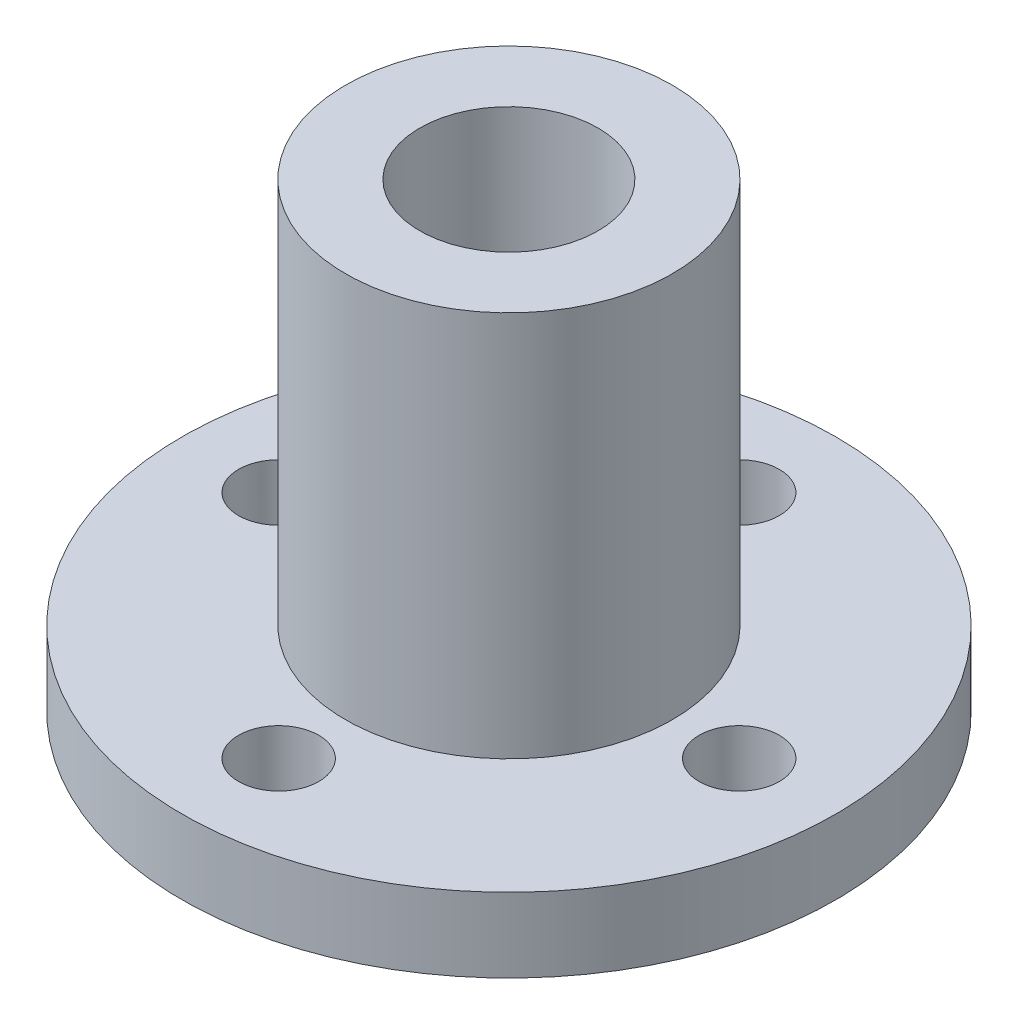
ISO-10303-21;
HEADER;
FILE_DESCRIPTION(('STEP AP214'),'2;1');
FILE_NAME('part.step','',(''),(''),'','','');
FILE_SCHEMA(('AUTOMOTIVE_DESIGN { 1 0 10303 214 1 1 1 1 }'));
ENDSEC;
DATA;
#1=APPLICATION_CONTEXT('core data for automotive mechanical design processes');
#2=APPLICATION_PROTOCOL_DEFINITION('international standard','automotive_design',2000,#1);
#3=PRODUCT_CONTEXT('',#1,'mechanical');
#4=PRODUCT('Part','Part','',(#3));
#5=PRODUCT_RELATED_PRODUCT_CATEGORY('part','',(#4));
#6=PRODUCT_DEFINITION_FORMATION('','',#4);
#7=PRODUCT_DEFINITION_CONTEXT('part definition',#1,'design');
#8=PRODUCT_DEFINITION('design','',#6,#7);
#9=PRODUCT_DEFINITION_SHAPE('','',#8);
#10=(LENGTH_UNIT() NAMED_UNIT(*) SI_UNIT(.MILLI.,.METRE.));
#11=(NAMED_UNIT(*) PLANE_ANGLE_UNIT() SI_UNIT($,.RADIAN.));
#12=(NAMED_UNIT(*) SI_UNIT($,.STERADIAN.) SOLID_ANGLE_UNIT());
#13=UNCERTAINTY_MEASURE_WITH_UNIT(LENGTH_MEASURE(1.E-05),#10,'distance_accuracy_value','');
#14=(GEOMETRIC_REPRESENTATION_CONTEXT(3) GLOBAL_UNCERTAINTY_ASSIGNED_CONTEXT((#13)) GLOBAL_UNIT_ASSIGNED_CONTEXT((#10,
#11,#12)) REPRESENTATION_CONTEXT('',''));
#15=CARTESIAN_POINT('',(0.,0.,0.));
#16=DIRECTION('',(0.,0.,1.));
#17=DIRECTION('',(1.,0.,0.));
#18=AXIS2_PLACEMENT_3D('',#15,#16,#17);
#19=CARTESIAN_POINT('',(0.,0.,0.));
#20=DIRECTION('',(0.,-1.,0.));
#21=DIRECTION('',(0.,0.,-1.));
#22=AXIS2_PLACEMENT_3D('',#19,#20,#21);
#23=CYLINDRICAL_SURFACE('',#22,6.);
#24=CARTESIAN_POINT('',(0.,0.,0.));
#25=DIRECTION('',(0.,-1.,0.));
#26=DIRECTION('',(0.,0.,-1.));
#27=AXIS2_PLACEMENT_3D('',#24,#25,#26);
#28=CIRCLE('',#27,6.);
#29=CARTESIAN_POINT('',(0.,0.,-6.));
#30=VERTEX_POINT('',#29);
#31=EDGE_CURVE('E10',#30,#30,#28,.T.);
#32=ORIENTED_EDGE('',*,*,#31,.T.);
#33=EDGE_LOOP('',(#32));
#34=FACE_BOUND('',#33,.T.);
#35=CARTESIAN_POINT('',(0.,31.,0.));
#36=DIRECTION('',(0.,-1.,0.));
#37=DIRECTION('',(0.,0.,-1.));
#38=AXIS2_PLACEMENT_3D('',#35,#36,#37);
#39=CIRCLE('',#38,6.);
#40=CARTESIAN_POINT('',(0.,31.,-6.));
#41=VERTEX_POINT('',#40);
#42=EDGE_CURVE('E50',#41,#41,#39,.T.);
#43=ORIENTED_EDGE('',*,*,#42,.F.);
#44=EDGE_LOOP('',(#43));
#45=FACE_BOUND('',#44,.T.);
#46=ADVANCED_FACE('F31',(#34,#45),#23,.F.);
#47=CARTESIAN_POINT('',(6.,0.,0.));
#48=DIRECTION('',(0.,-1.,0.));
#49=DIRECTION('',(0.,0.,-1.));
#50=AXIS2_PLACEMENT_3D('',#47,#48,#49);
#51=PLANE('',#50);
#52=CARTESIAN_POINT('',(-15.5,0.,0.));
#53=DIRECTION('',(0.,-1.,0.));
#54=DIRECTION('',(0.,0.,-1.));
#55=AXIS2_PLACEMENT_3D('',#52,#53,#54);
#56=CIRCLE('',#55,2.7);
#57=CARTESIAN_POINT('',(-15.5,0.,-2.7));
#58=VERTEX_POINT('',#57);
#59=EDGE_CURVE('E67',#58,#58,#56,.T.);
#60=ORIENTED_EDGE('',*,*,#59,.F.);
#61=EDGE_LOOP('',(#60));
#62=FACE_BOUND('',#61,.T.);
#63=CARTESIAN_POINT('',(0.,0.,-15.5));
#64=DIRECTION('',(0.,-1.,0.));
#65=DIRECTION('',(0.,0.,-1.));
#66=AXIS2_PLACEMENT_3D('',#63,#64,#65);
#67=CIRCLE('',#66,2.7);
#68=CARTESIAN_POINT('',(0.,0.,-18.2));
#69=VERTEX_POINT('',#68);
#70=EDGE_CURVE('E57',#69,#69,#67,.T.);
#71=ORIENTED_EDGE('',*,*,#70,.F.);
#72=EDGE_LOOP('',(#71));
#73=FACE_BOUND('',#72,.T.);
#74=CARTESIAN_POINT('',(15.5,0.,0.));
#75=DIRECTION('',(0.,-1.,0.));
#76=DIRECTION('',(0.,0.,-1.));
#77=AXIS2_PLACEMENT_3D('',#74,#75,#76);
#78=CIRCLE('',#77,2.7);
#79=CARTESIAN_POINT('',(15.5,0.,-2.7));
#80=VERTEX_POINT('',#79);
#81=EDGE_CURVE('E54',#80,#80,#78,.T.);
#82=ORIENTED_EDGE('',*,*,#81,.F.);
#83=EDGE_LOOP('',(#82));
#84=FACE_BOUND('',#83,.T.);
#85=CARTESIAN_POINT('',(0.,0.,15.5));
#86=DIRECTION('',(0.,-1.,0.));
#87=DIRECTION('',(0.,0.,-1.));
#88=AXIS2_PLACEMENT_3D('',#85,#86,#87);
#89=CIRCLE('',#88,2.7);
#90=CARTESIAN_POINT('',(0.,0.,12.8));
#91=VERTEX_POINT('',#90);
#92=EDGE_CURVE('E51',#91,#91,#89,.T.);
#93=ORIENTED_EDGE('',*,*,#92,.F.);
#94=EDGE_LOOP('',(#93));
#95=FACE_BOUND('',#94,.T.);
#96=CARTESIAN_POINT('',(0.,0.,0.));
#97=DIRECTION('',(0.,-1.,0.));
#98=DIRECTION('',(0.,0.,-1.));
#99=AXIS2_PLACEMENT_3D('',#96,#97,#98);
#100=CIRCLE('',#99,22.);
#101=CARTESIAN_POINT('',(0.,0.,-22.));
#102=VERTEX_POINT('',#101);
#103=EDGE_CURVE('E38',#102,#102,#100,.T.);
#104=ORIENTED_EDGE('',*,*,#103,.T.);
#105=EDGE_LOOP('',(#104));
#106=FACE_BOUND('',#105,.T.);
#107=ORIENTED_EDGE('',*,*,#31,.F.);
#108=EDGE_LOOP('',(#107));
#109=FACE_BOUND('',#108,.T.);
#110=ADVANCED_FACE('F97',(#62,#73,#84,#95,#106,#109),#51,.T.);
#111=CARTESIAN_POINT('',(0.,0.,0.));
#112=DIRECTION('',(0.,-1.,0.));
#113=DIRECTION('',(0.,0.,-1.));
#114=AXIS2_PLACEMENT_3D('',#111,#112,#113);
#115=CYLINDRICAL_SURFACE('',#114,22.);
#116=CARTESIAN_POINT('',(0.,5.,0.));
#117=DIRECTION('',(0.,-1.,0.));
#118=DIRECTION('',(0.,0.,-1.));
#119=AXIS2_PLACEMENT_3D('',#116,#117,#118);
#120=CIRCLE('',#119,22.);
#121=CARTESIAN_POINT('',(0.,5.,-22.));
#122=VERTEX_POINT('',#121);
#123=EDGE_CURVE('E43',#122,#122,#120,.T.);
#124=ORIENTED_EDGE('',*,*,#123,.T.);
#125=EDGE_LOOP('',(#124));
#126=FACE_BOUND('',#125,.T.);
#127=ORIENTED_EDGE('',*,*,#103,.F.);
#128=EDGE_LOOP('',(#127));
#129=FACE_BOUND('',#128,.T.);
#130=ADVANCED_FACE('F82',(#126,#129),#115,.T.);
#131=CARTESIAN_POINT('',(22.,5.,0.));
#132=DIRECTION('',(0.,1.,0.));
#133=DIRECTION('',(0.,0.,1.));
#134=AXIS2_PLACEMENT_3D('',#131,#132,#133);
#135=PLANE('',#134);
#136=CARTESIAN_POINT('',(-15.5,5.,0.));
#137=DIRECTION('',(0.,1.,0.));
#138=DIRECTION('',(0.,0.,1.));
#139=AXIS2_PLACEMENT_3D('',#136,#137,#138);
#140=CIRCLE('',#139,2.7);
#141=CARTESIAN_POINT('',(-15.5,5.,2.7));
#142=VERTEX_POINT('',#141);
#143=EDGE_CURVE('E34',#142,#142,#140,.T.);
#144=ORIENTED_EDGE('',*,*,#143,.F.);
#145=EDGE_LOOP('',(#144));
#146=FACE_BOUND('',#145,.T.);
#147=CARTESIAN_POINT('',(0.,5.,-15.5));
#148=DIRECTION('',(0.,1.,0.));
#149=DIRECTION('',(0.,0.,1.));
#150=AXIS2_PLACEMENT_3D('',#147,#148,#149);
#151=CIRCLE('',#150,2.7);
#152=CARTESIAN_POINT('',(0.,5.,-12.8));
#153=VERTEX_POINT('',#152);
#154=EDGE_CURVE('E55',#153,#153,#151,.T.);
#155=ORIENTED_EDGE('',*,*,#154,.F.);
#156=EDGE_LOOP('',(#155));
#157=FACE_BOUND('',#156,.T.);
#158=CARTESIAN_POINT('',(15.5,5.,0.));
#159=DIRECTION('',(0.,1.,0.));
#160=DIRECTION('',(0.,0.,1.));
#161=AXIS2_PLACEMENT_3D('',#158,#159,#160);
#162=CIRCLE('',#161,2.7);
#163=CARTESIAN_POINT('',(15.5,5.,2.7));
#164=VERTEX_POINT('',#163);
#165=EDGE_CURVE('E52',#164,#164,#162,.T.);
#166=ORIENTED_EDGE('',*,*,#165,.F.);
#167=EDGE_LOOP('',(#166));
#168=FACE_BOUND('',#167,.T.);
#169=CARTESIAN_POINT('',(0.,5.,15.5));
#170=DIRECTION('',(0.,1.,0.));
#171=DIRECTION('',(0.,0.,1.));
#172=AXIS2_PLACEMENT_3D('',#169,#170,#171);
#173=CIRCLE('',#172,2.7);
#174=CARTESIAN_POINT('',(0.,5.,18.2));
#175=VERTEX_POINT('',#174);
#176=EDGE_CURVE('E47',#175,#175,#173,.T.);
#177=ORIENTED_EDGE('',*,*,#176,.F.);
#178=EDGE_LOOP('',(#177));
#179=FACE_BOUND('',#178,.T.);
#180=CARTESIAN_POINT('',(0.,5.,0.));
#181=DIRECTION('',(0.,-1.,0.));
#182=DIRECTION('',(0.,0.,-1.));
#183=AXIS2_PLACEMENT_3D('',#180,#181,#182);
#184=CIRCLE('',#183,11.);
#185=CARTESIAN_POINT('',(0.,5.,-11.));
#186=VERTEX_POINT('',#185);
#187=EDGE_CURVE('E77',#186,#186,#184,.T.);
#188=ORIENTED_EDGE('',*,*,#187,.T.);
#189=EDGE_LOOP('',(#188));
#190=FACE_BOUND('',#189,.T.);
#191=ORIENTED_EDGE('',*,*,#123,.F.);
#192=EDGE_LOOP('',(#191));
#193=FACE_BOUND('',#192,.T.);
#194=ADVANCED_FACE('F85',(#146,#157,#168,#179,#190,#193),#135,.T.);
#195=CARTESIAN_POINT('',(0.,0.,0.));
#196=DIRECTION('',(0.,-1.,0.));
#197=DIRECTION('',(0.,0.,-1.));
#198=AXIS2_PLACEMENT_3D('',#195,#196,#197);
#199=CYLINDRICAL_SURFACE('',#198,11.);
#200=CARTESIAN_POINT('',(0.,31.,0.));
#201=DIRECTION('',(0.,-1.,0.));
#202=DIRECTION('',(0.,0.,-1.));
#203=AXIS2_PLACEMENT_3D('',#200,#201,#202);
#204=CIRCLE('',#203,11.);
#205=CARTESIAN_POINT('',(0.,31.,-11.));
#206=VERTEX_POINT('',#205);
#207=EDGE_CURVE('E74',#206,#206,#204,.T.);
#208=ORIENTED_EDGE('',*,*,#207,.T.);
#209=EDGE_LOOP('',(#208));
#210=FACE_BOUND('',#209,.T.);
#211=ORIENTED_EDGE('',*,*,#187,.F.);
#212=EDGE_LOOP('',(#211));
#213=FACE_BOUND('',#212,.T.);
#214=ADVANCED_FACE('F87',(#210,#213),#199,.T.);
#215=CARTESIAN_POINT('',(11.,31.,0.));
#216=DIRECTION('',(0.,1.,0.));
#217=DIRECTION('',(0.,0.,1.));
#218=AXIS2_PLACEMENT_3D('',#215,#216,#217);
#219=PLANE('',#218);
#220=ORIENTED_EDGE('',*,*,#42,.T.);
#221=EDGE_LOOP('',(#220));
#222=FACE_BOUND('',#221,.T.);
#223=ORIENTED_EDGE('',*,*,#207,.F.);
#224=EDGE_LOOP('',(#223));
#225=FACE_BOUND('',#224,.T.);
#226=ADVANCED_FACE('F94',(#222,#225),#219,.T.);
#227=CARTESIAN_POINT('',(0.,10.,15.5));
#228=DIRECTION('',(0.,-1.,0.));
#229=DIRECTION('',(0.,0.,-1.));
#230=AXIS2_PLACEMENT_3D('',#227,#228,#229);
#231=CYLINDRICAL_SURFACE('',#230,2.7);
#232=ORIENTED_EDGE('',*,*,#176,.T.);
#233=EDGE_LOOP('',(#232));
#234=FACE_BOUND('',#233,.T.);
#235=ORIENTED_EDGE('',*,*,#92,.T.);
#236=EDGE_LOOP('',(#235));
#237=FACE_BOUND('',#236,.T.);
#238=ADVANCED_FACE('F111',(#234,#237),#231,.F.);
#239=CARTESIAN_POINT('',(15.5,10.,0.));
#240=DIRECTION('',(0.,-1.,0.));
#241=DIRECTION('',(0.,0.,-1.));
#242=AXIS2_PLACEMENT_3D('',#239,#240,#241);
#243=CYLINDRICAL_SURFACE('',#242,2.7);
#244=ORIENTED_EDGE('',*,*,#165,.T.);
#245=EDGE_LOOP('',(#244));
#246=FACE_BOUND('',#245,.T.);
#247=ORIENTED_EDGE('',*,*,#81,.T.);
#248=EDGE_LOOP('',(#247));
#249=FACE_BOUND('',#248,.T.);
#250=ADVANCED_FACE('F120',(#246,#249),#243,.F.);
#251=CARTESIAN_POINT('',(0.,10.,-15.5));
#252=DIRECTION('',(0.,-1.,0.));
#253=DIRECTION('',(0.,0.,-1.));
#254=AXIS2_PLACEMENT_3D('',#251,#252,#253);
#255=CYLINDRICAL_SURFACE('',#254,2.7);
#256=ORIENTED_EDGE('',*,*,#154,.T.);
#257=EDGE_LOOP('',(#256));
#258=FACE_BOUND('',#257,.T.);
#259=ORIENTED_EDGE('',*,*,#70,.T.);
#260=EDGE_LOOP('',(#259));
#261=FACE_BOUND('',#260,.T.);
#262=ADVANCED_FACE('F126',(#258,#261),#255,.F.);
#263=CARTESIAN_POINT('',(-15.5,10.,0.));
#264=DIRECTION('',(0.,-1.,0.));
#265=DIRECTION('',(0.,0.,-1.));
#266=AXIS2_PLACEMENT_3D('',#263,#264,#265);
#267=CYLINDRICAL_SURFACE('',#266,2.7);
#268=ORIENTED_EDGE('',*,*,#143,.T.);
#269=EDGE_LOOP('',(#268));
#270=FACE_BOUND('',#269,.T.);
#271=ORIENTED_EDGE('',*,*,#59,.T.);
#272=EDGE_LOOP('',(#271));
#273=FACE_BOUND('',#272,.T.);
#274=ADVANCED_FACE('F130',(#270,#273),#267,.F.);
#275=CLOSED_SHELL('',(#46,#110,#130,#194,#214,#226,#238,#250,#262,#274));
#276=MANIFOLD_SOLID_BREP('B2',#275);
#277=ADVANCED_BREP_SHAPE_REPRESENTATION('',(#18,#276),#14);
#278=SHAPE_DEFINITION_REPRESENTATION(#9,#277);
ENDSEC;
END-ISO-10303-21;
